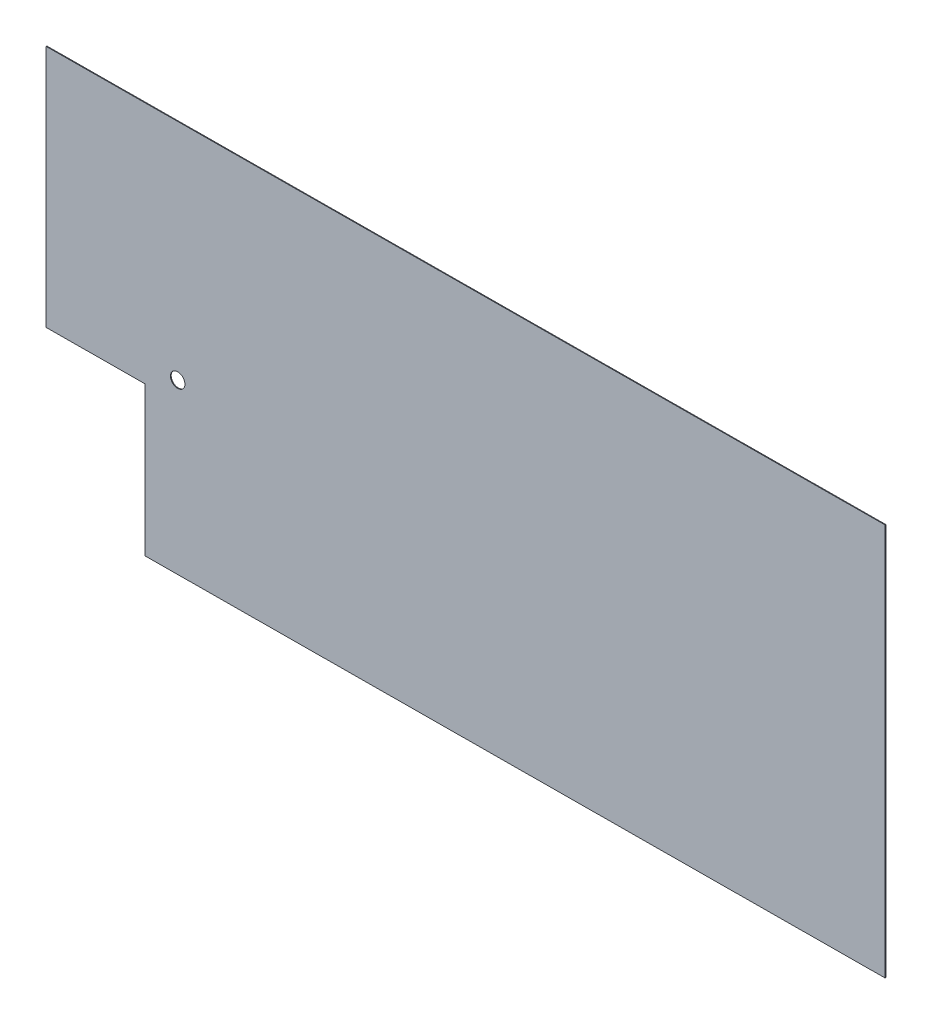
ISO-10303-21;
HEADER;
FILE_DESCRIPTION(('STEP AP214'),'2;1');
FILE_NAME('part.step','',(''),(''),'','','');
FILE_SCHEMA(('AUTOMOTIVE_DESIGN { 1 0 10303 214 1 1 1 1 }'));
ENDSEC;
DATA;
#1=APPLICATION_CONTEXT('core data for automotive mechanical design processes');
#2=APPLICATION_PROTOCOL_DEFINITION('international standard','automotive_design',2000,#1);
#3=PRODUCT_CONTEXT('',#1,'mechanical');
#4=PRODUCT('Part','Part','',(#3));
#5=PRODUCT_RELATED_PRODUCT_CATEGORY('part','',(#4));
#6=PRODUCT_DEFINITION_FORMATION('','',#4);
#7=PRODUCT_DEFINITION_CONTEXT('part definition',#1,'design');
#8=PRODUCT_DEFINITION('design','',#6,#7);
#9=PRODUCT_DEFINITION_SHAPE('','',#8);
#10=(LENGTH_UNIT() NAMED_UNIT(*) SI_UNIT(.MILLI.,.METRE.));
#11=(NAMED_UNIT(*) PLANE_ANGLE_UNIT() SI_UNIT($,.RADIAN.));
#12=(NAMED_UNIT(*) SI_UNIT($,.STERADIAN.) SOLID_ANGLE_UNIT());
#13=UNCERTAINTY_MEASURE_WITH_UNIT(LENGTH_MEASURE(1.E-05),#10,'distance_accuracy_value','');
#14=(GEOMETRIC_REPRESENTATION_CONTEXT(3) GLOBAL_UNCERTAINTY_ASSIGNED_CONTEXT((#13)) GLOBAL_UNIT_ASSIGNED_CONTEXT((#10,
#11,#12)) REPRESENTATION_CONTEXT('',''));
#15=CARTESIAN_POINT('',(0.,0.,0.));
#16=DIRECTION('',(0.,0.,1.));
#17=DIRECTION('',(1.,0.,0.));
#18=AXIS2_PLACEMENT_3D('',#15,#16,#17);
#19=CARTESIAN_POINT('',(-4.99393203883525,754.,-822.984848367691));
#20=DIRECTION('',(0.999981589754181,0.,-0.00606796116504866));
#21=DIRECTION('',(0.,1.,0.));
#22=AXIS2_PLACEMENT_3D('',#19,#20,#21);
#23=PLANE('',#22);
#24=DIRECTION('',(0.00606796116504866,0.,0.999981589754181));
#25=VECTOR('',#24,1.);
#26=CARTESIAN_POINT('',(-4.99393203883525,1093.,-822.984848367691));
#27=LINE('',#26,#25);
#28=CARTESIAN_POINT('',(-5.00000000000078,1093.,-823.984829957446));
#29=VERTEX_POINT('',#28);
#30=CARTESIAN_POINT('',(-4.9878640776706,1093.,-821.984866777937));
#31=VERTEX_POINT('',#30);
#32=EDGE_CURVE('E11',#29,#31,#27,.T.);
#33=ORIENTED_EDGE('',*,*,#32,.F.);
#34=DIRECTION('',(0.,1.,0.));
#35=VECTOR('',#34,1.);
#36=CARTESIAN_POINT('',(-5.00000000000078,754.,-823.984829957446));
#37=LINE('',#36,#35);
#38=CARTESIAN_POINT('',(-5.00000000000078,415.,-823.984829957446));
#39=VERTEX_POINT('',#38);
#40=EDGE_CURVE('E118',#29,#39,#37,.F.);
#41=ORIENTED_EDGE('',*,*,#40,.T.);
#42=DIRECTION('',(0.00606796116504866,0.,0.999981589754181));
#43=VECTOR('',#42,1.);
#44=CARTESIAN_POINT('',(-4.99393203883525,415.,-822.984848367691));
#45=LINE('',#44,#43);
#46=CARTESIAN_POINT('',(-4.9878640776706,415.,-821.984866777937));
#47=VERTEX_POINT('',#46);
#48=EDGE_CURVE('E51',#39,#47,#45,.T.);
#49=ORIENTED_EDGE('',*,*,#48,.T.);
#50=DIRECTION('',(0.,1.,0.));
#51=VECTOR('',#50,1.);
#52=CARTESIAN_POINT('',(-4.9878640776706,754.,-821.984866777937));
#53=LINE('',#52,#51);
#54=EDGE_CURVE('E131',#31,#47,#53,.F.);
#55=ORIENTED_EDGE('',*,*,#54,.F.);
#56=EDGE_LOOP('',(#33,#41,#49,#55));
#57=FACE_BOUND('',#56,.T.);
#58=ADVANCED_FACE('F40',(#57),#23,.F.);
#59=CARTESIAN_POINT('',(1156.30423815181,415.,-830.031690299542));
#60=DIRECTION('',(0.,-1.,0.));
#61=DIRECTION('',(0.999981589754181,0.,-0.00606796116504866));
#62=AXIS2_PLACEMENT_3D('',#59,#60,#61);
#63=PLANE('',#62);
#64=ORIENTED_EDGE('',*,*,#48,.F.);
#65=DIRECTION('',(0.999981589754181,0.,-0.00606796116504866));
#66=VECTOR('',#65,1.);
#67=CARTESIAN_POINT('',(1156.29817019064,415.,-831.031671889297));
#68=LINE('',#67,#66);
#69=CARTESIAN_POINT('',(267.874554757334,415.,-825.640652642746));
#70=VERTEX_POINT('',#69);
#71=EDGE_CURVE('E111',#39,#70,#68,.T.);
#72=ORIENTED_EDGE('',*,*,#71,.T.);
#73=DIRECTION('',(-0.325913241594478,0.,-0.945399682120414));
#74=VECTOR('',#73,1.);
#75=CARTESIAN_POINT('',(268.562600007169,415.,-823.644790930296));
#76=LINE('',#75,#74);
#77=CARTESIAN_POINT('',(268.562600007169,415.,-823.644790930296));
#78=VERTEX_POINT('',#77);
#79=EDGE_CURVE('E96',#70,#78,#76,.F.);
#80=ORIENTED_EDGE('',*,*,#79,.T.);
#81=DIRECTION('',(0.999981589754181,0.,-0.00606796116504866));
#82=VECTOR('',#81,1.);
#83=CARTESIAN_POINT('',(1156.31030611297,415.,-829.031708709788));
#84=LINE('',#83,#82);
#85=EDGE_CURVE('E143',#47,#78,#84,.T.);
#86=ORIENTED_EDGE('',*,*,#85,.F.);
#87=EDGE_LOOP('',(#64,#72,#80,#86));
#88=FACE_BOUND('',#87,.T.);
#89=ADVANCED_FACE('F115',(#88),#63,.T.);
#90=CARTESIAN_POINT('',(268.562600007169,415.,-823.644790930296));
#91=DIRECTION('',(0.945399682120414,0.,-0.325913241594478));
#92=DIRECTION('',(-0.325913241594478,0.,-0.945399682120414));
#93=AXIS2_PLACEMENT_3D('',#90,#91,#92);
#94=PLANE('',#93);
#95=ORIENTED_EDGE('',*,*,#79,.F.);
#96=DIRECTION('',(0.,1.,0.));
#97=VECTOR('',#96,1.);
#98=CARTESIAN_POINT('',(267.874554757334,754.000000000001,-825.640652642746));
#99=LINE('',#98,#97);
#100=CARTESIAN_POINT('',(267.874554757333,1.11022302462516E-13,-825.640652642746));
#101=VERTEX_POINT('',#100);
#102=EDGE_CURVE('E44',#70,#101,#99,.F.);
#103=ORIENTED_EDGE('',*,*,#102,.T.);
#104=DIRECTION('',(-0.325913241594478,0.,-0.945399682120414));
#105=VECTOR('',#104,1.);
#106=CARTESIAN_POINT('',(268.562600007168,0.,-823.644790930296));
#107=LINE('',#106,#105);
#108=CARTESIAN_POINT('',(268.562600007169,1.11022302462516E-13,-823.644790930297));
#109=VERTEX_POINT('',#108);
#110=EDGE_CURVE('E90',#101,#109,#107,.F.);
#111=ORIENTED_EDGE('',*,*,#110,.T.);
#112=DIRECTION('',(0.,1.,0.));
#113=VECTOR('',#112,1.);
#114=CARTESIAN_POINT('',(268.562600007169,754.000000000001,-823.644790930296));
#115=LINE('',#114,#113);
#116=EDGE_CURVE('E99',#78,#109,#115,.F.);
#117=ORIENTED_EDGE('',*,*,#116,.F.);
#118=EDGE_LOOP('',(#95,#103,#111,#117));
#119=FACE_BOUND('',#118,.T.);
#120=ADVANCED_FACE('F42',(#119),#94,.F.);
#121=CARTESIAN_POINT('',(1156.30423815181,0.,-830.031690299542));
#122=DIRECTION('',(0.,-1.,0.));
#123=DIRECTION('',(0.999981589754181,0.,-0.00606796116504866));
#124=AXIS2_PLACEMENT_3D('',#121,#122,#123);
#125=PLANE('',#124);
#126=ORIENTED_EDGE('',*,*,#110,.F.);
#127=DIRECTION('',(0.999981589754181,0.,-0.00606796116504866));
#128=VECTOR('',#127,1.);
#129=CARTESIAN_POINT('',(1156.29817019064,1.11022302462516E-13,-831.031671889297));
#130=LINE('',#129,#128);
#131=CARTESIAN_POINT('',(2317.59634038129,0.,-838.078513821148));
#132=VERTEX_POINT('',#131);
#133=EDGE_CURVE('E113',#101,#132,#130,.T.);
#134=ORIENTED_EDGE('',*,*,#133,.T.);
#135=DIRECTION('',(0.00606796116504866,0.,0.999981589754181));
#136=VECTOR('',#135,1.);
#137=CARTESIAN_POINT('',(2317.60240834245,0.,-837.078532231394));
#138=LINE('',#137,#136);
#139=CARTESIAN_POINT('',(2317.60847630362,0.,-836.078550641639));
#140=VERTEX_POINT('',#139);
#141=EDGE_CURVE('E133',#132,#140,#138,.T.);
#142=ORIENTED_EDGE('',*,*,#141,.T.);
#143=DIRECTION('',(0.999981589754181,0.,-0.00606796116504866));
#144=VECTOR('',#143,1.);
#145=CARTESIAN_POINT('',(1156.31030611297,1.11022302462516E-13,-829.031708709788));
#146=LINE('',#145,#144);
#147=EDGE_CURVE('E142',#109,#140,#146,.T.);
#148=ORIENTED_EDGE('',*,*,#147,.F.);
#149=EDGE_LOOP('',(#126,#134,#142,#148));
#150=FACE_BOUND('',#149,.T.);
#151=ADVANCED_FACE('F151',(#150),#125,.T.);
#152=CARTESIAN_POINT('',(2317.60240834245,754.,-837.078532231394));
#153=DIRECTION('',(0.999981589754181,0.,-0.00606796116504866));
#154=DIRECTION('',(0.,1.,0.));
#155=AXIS2_PLACEMENT_3D('',#152,#153,#154);
#156=PLANE('',#155);
#157=ORIENTED_EDGE('',*,*,#141,.F.);
#158=DIRECTION('',(0.,1.,0.));
#159=VECTOR('',#158,1.);
#160=CARTESIAN_POINT('',(2317.59634038129,754.,-838.078513821148));
#161=LINE('',#160,#159);
#162=CARTESIAN_POINT('',(2317.59634038129,1093.,-838.078513821148));
#163=VERTEX_POINT('',#162);
#164=EDGE_CURVE('E132',#132,#163,#161,.T.);
#165=ORIENTED_EDGE('',*,*,#164,.T.);
#166=DIRECTION('',(0.00606796116504866,0.,0.999981589754181));
#167=VECTOR('',#166,1.);
#168=CARTESIAN_POINT('',(2317.60240834245,1093.,-837.078532231394));
#169=LINE('',#168,#167);
#170=CARTESIAN_POINT('',(2317.60847630362,1093.,-836.078550641639));
#171=VERTEX_POINT('',#170);
#172=EDGE_CURVE('E60',#163,#171,#169,.T.);
#173=ORIENTED_EDGE('',*,*,#172,.T.);
#174=DIRECTION('',(0.,1.,0.));
#175=VECTOR('',#174,1.);
#176=CARTESIAN_POINT('',(2317.60847630362,754.,-836.078550641639));
#177=LINE('',#176,#175);
#178=EDGE_CURVE('E152',#140,#171,#177,.T.);
#179=ORIENTED_EDGE('',*,*,#178,.F.);
#180=EDGE_LOOP('',(#157,#165,#173,#179));
#181=FACE_BOUND('',#180,.T.);
#182=ADVANCED_FACE('F218',(#181),#156,.T.);
#183=CARTESIAN_POINT('',(1156.30423815181,1093.,-830.031690299542));
#184=DIRECTION('',(0.,-1.,0.));
#185=DIRECTION('',(0.999981589754181,0.,-0.00606796116504866));
#186=AXIS2_PLACEMENT_3D('',#183,#184,#185);
#187=PLANE('',#186);
#188=DIRECTION('',(0.999981589754181,0.,-0.00606796116504866));
#189=VECTOR('',#188,1.);
#190=CARTESIAN_POINT('',(1156.29817019064,1093.,-831.031671889297));
#191=LINE('',#190,#189);
#192=EDGE_CURVE('E127',#163,#29,#191,.F.);
#193=ORIENTED_EDGE('',*,*,#192,.T.);
#194=ORIENTED_EDGE('',*,*,#32,.T.);
#195=DIRECTION('',(0.999981589754181,0.,-0.00606796116504866));
#196=VECTOR('',#195,1.);
#197=CARTESIAN_POINT('',(1156.31030611297,1093.,-829.031708709788));
#198=LINE('',#197,#196);
#199=EDGE_CURVE('E139',#171,#31,#198,.F.);
#200=ORIENTED_EDGE('',*,*,#199,.F.);
#201=ORIENTED_EDGE('',*,*,#172,.F.);
#202=EDGE_LOOP('',(#193,#194,#200,#201));
#203=FACE_BOUND('',#202,.T.);
#204=ADVANCED_FACE('F216',(#203),#187,.F.);
#205=CARTESIAN_POINT('',(1156.31030611297,754.,-829.031708709788));
#206=DIRECTION('',(0.00606796116504866,0.,0.999981589754181));
#207=DIRECTION('',(0.999981589754181,0.,-0.00606796116504866));
#208=AXIS2_PLACEMENT_3D('',#205,#206,#207);
#209=PLANE('',#208);
#210=CARTESIAN_POINT('',(339.074950675495,469.0000000268,-824.072665013075));
#211=CARTESIAN_POINT('',(339.074952175354,468.328584783968,-824.072665022177));
#212=CARTESIAN_POINT('',(339.109270419942,467.657108868376,-824.072873267786));
#213=CARTESIAN_POINT('',(339.245169879086,466.321042548984,-824.073697915608));
#214=CARTESIAN_POINT('',(339.346748960097,465.656451927458,-824.074314304875));
#215=CARTESIAN_POINT('',(339.593612302406,464.449151278049,-824.075812289627));
#216=CARTESIAN_POINT('',(339.728953983658,463.904381306161,-824.076633552813));
#217=CARTESIAN_POINT('',(340.044908442255,462.827879149409,-824.078550787494));
#218=CARTESIAN_POINT('',(340.225531299392,462.296149896439,-824.079646820155));
#219=CARTESIAN_POINT('',(340.529891044368,461.51132230611,-824.081493697269));
#220=CARTESIAN_POINT('',(340.637000907703,461.251665596134,-824.082143647726));
#221=CARTESIAN_POINT('',(340.86218373962,460.737150092206,-824.083510073562));
#222=CARTESIAN_POINT('',(340.980256731423,460.482291308418,-824.084226549081));
#223=CARTESIAN_POINT('',(341.350458081397,459.725569546191,-824.086472957853));
#224=CARTESIAN_POINT('',(341.618616336485,459.231438855324,-824.088100161688));
#225=CARTESIAN_POINT('',(342.195074381275,458.267799266706,-824.091598151116));
#226=CARTESIAN_POINT('',(342.503342534786,457.798271368953,-824.093468744738));
#227=CARTESIAN_POINT('',(343.158007303258,456.886586975724,-824.097441298265));
#228=CARTESIAN_POINT('',(343.504402925405,456.444429768001,-824.099543252145));
#229=CARTESIAN_POINT('',(344.23306707273,455.590874551994,-824.103964839296));
#230=CARTESIAN_POINT('',(344.615328194218,455.179470226782,-824.10628442764));
#231=CARTESIAN_POINT('',(345.413449958345,454.390659581939,-824.111127488672));
#232=CARTESIAN_POINT('',(345.829310711533,454.013253374179,-824.11365096203));
#233=CARTESIAN_POINT('',(346.692037001546,453.293955871417,-824.118886048033));
#234=CARTESIAN_POINT('',(347.138960933633,452.952134658138,-824.121598015025));
#235=CARTESIAN_POINT('',(348.059793722772,452.307013749988,-824.1271856955));
#236=CARTESIAN_POINT('',(348.533703530013,452.003715412744,-824.130061414748));
#237=CARTESIAN_POINT('',(349.505342994727,451.437768861924,-824.135957393833));
#238=CARTESIAN_POINT('',(350.003074469016,451.175123755352,-824.138977664694));
#239=CARTESIAN_POINT('',(350.764818901969,450.813411875849,-824.143599985429));
#240=CARTESIAN_POINT('',(351.021279558414,450.698209217535,-824.145156207383));
#241=CARTESIAN_POINT('',(351.538873406772,450.478828487614,-824.148297004576));
#242=CARTESIAN_POINT('',(351.800006590889,450.374650397616,-824.149881579769));
#243=CARTESIAN_POINT('',(352.590833119863,450.078427140048,-824.154680372782));
#244=CARTESIAN_POINT('',(353.126924769694,449.903181193952,-824.157933415983));
#245=CARTESIAN_POINT('',(354.211890570841,449.598290184663,-824.164517067537));
#246=CARTESIAN_POINT('',(354.760765850328,449.468649162546,-824.167847682735));
#247=CARTESIAN_POINT('',(355.867441774931,449.255716661479,-824.1745630729));
#248=CARTESIAN_POINT('',(356.425242535724,449.172425783747,-824.177947848568));
#249=CARTESIAN_POINT('',(357.545899357321,449.052978130169,-824.184748075835));
#250=CARTESIAN_POINT('',(358.108754956869,449.016817096848,-824.188163524634));
#251=CARTESIAN_POINT('',(358.954231121697,448.998541146611,-824.19329393562));
#252=CARTESIAN_POINT('',(359.236562343049,448.998462945255,-824.195007142048));
#253=CARTESIAN_POINT('',(359.800971447485,449.010350512539,-824.198432017627));
#254=CARTESIAN_POINT('',(360.083049329275,449.022316342317,-824.200143686772));
#255=CARTESIAN_POINT('',(360.928159622313,449.07611148578,-824.205271877621));
#256=CARTESIAN_POINT('',(361.490153407282,449.135836677355,-824.208682096867));
#257=CARTESIAN_POINT('',(362.60705317246,449.302214176087,-824.215459526041));
#258=CARTESIAN_POINT('',(363.161959347974,449.408865187283,-824.218826737155));
#259=CARTESIAN_POINT('',(364.260873553531,449.668306810475,-824.225495028644));
#260=CARTESIAN_POINT('',(364.80488214217,449.821095051048,-824.228796112407));
#261=CARTESIAN_POINT('',(365.877594682711,450.17193830677,-824.235305410282));
#262=CARTESIAN_POINT('',(366.406311487938,450.369953982559,-824.238513702389));
#263=CARTESIAN_POINT('',(367.444915217162,450.810400686034,-824.24481602551));
#264=CARTESIAN_POINT('',(367.954801897487,451.052832288242,-824.247910055047));
#265=CARTESIAN_POINT('',(368.952320239554,451.579740142177,-824.253963069046));
#266=CARTESIAN_POINT('',(369.439953009069,451.86421429808,-824.25692206023));
#267=CARTESIAN_POINT('',(370.389667241782,452.47301412735,-824.262684995409));
#268=CARTESIAN_POINT('',(370.851748060552,452.797340805143,-824.265488935494));
#269=CARTESIAN_POINT('',(371.746367629377,453.483156167313,-824.270917552237));
#270=CARTESIAN_POINT('',(372.178953299703,453.844583423546,-824.273542513611));
#271=CARTESIAN_POINT('',(372.803609770618,454.413112882475,-824.277332974601));
#272=CARTESIAN_POINT('',(373.007807454583,454.607037906361,-824.278572061029));
#273=CARTESIAN_POINT('',(373.407732098095,455.00343441923,-824.280998832913));
#274=CARTESIAN_POINT('',(373.603459064168,455.205905901629,-824.282186518407));
#275=CARTESIAN_POINT('',(374.177444300262,455.825479544812,-824.285669502652));
#276=CARTESIAN_POINT('',(374.542616220354,456.254840469881,-824.287885392477));
#277=CARTESIAN_POINT('',(375.235603274204,457.142682538101,-824.292090488424));
#278=CARTESIAN_POINT('',(375.563415260795,457.601166129461,-824.294079675449));
#279=CARTESIAN_POINT('',(376.178940525812,458.543145122823,-824.297814727617));
#280=CARTESIAN_POINT('',(376.466723787482,459.02659479323,-824.299561017422));
#281=CARTESIAN_POINT('',(377.000654100661,460.015999684072,-824.302800945476));
#282=CARTESIAN_POINT('',(377.246805072431,460.521952779822,-824.304294607512));
#283=CARTESIAN_POINT('',(377.583000145425,461.295099422616,-824.306334663716));
#284=CARTESIAN_POINT('',(377.689570187765,461.555214884852,-824.3069813385));
#285=CARTESIAN_POINT('',(377.891539954353,462.079747459035,-824.308206905763));
#286=CARTESIAN_POINT('',(377.98693961477,462.344164595553,-824.308785797855));
#287=CARTESIAN_POINT('',(378.25625194264,463.143126324075,-824.310420004688));
#288=CARTESIAN_POINT('',(378.413311055489,463.683457490496,-824.311373050831));
#289=CARTESIAN_POINT('',(378.681368127529,464.774449967184,-824.31299964068));
#290=CARTESIAN_POINT('',(378.792437652468,465.325093823066,-824.313673618653));
#291=CARTESIAN_POINT('',(378.968135056628,466.433734533422,-824.314739763306));
#292=CARTESIAN_POINT('',(379.032765560813,466.991730970475,-824.315131945916));
#293=CARTESIAN_POINT('',(379.114734102223,468.111222716915,-824.315629336999));
#294=CARTESIAN_POINT('',(379.132070318143,468.672718160215,-824.315734534421));
#295=CARTESIAN_POINT('',(379.118809720978,469.795148377628,-824.31565406815));
#296=CARTESIAN_POINT('',(379.088212075772,470.356083141839,-824.315468399409));
#297=CARTESIAN_POINT('',(378.980024848169,471.473159084359,-824.314811911427));
#298=CARTESIAN_POINT('',(378.902454287958,472.02930211072,-824.314341207615));
#299=CARTESIAN_POINT('',(378.70111444451,473.133154837478,-824.313119462771));
#300=CARTESIAN_POINT('',(378.577344069219,473.680864338209,-824.312368415114));
#301=CARTESIAN_POINT('',(378.284339120088,474.764093713258,-824.310590439728));
#302=CARTESIAN_POINT('',(378.115102697336,475.299613090895,-824.309563500781));
#303=CARTESIAN_POINT('',(377.82781033987,476.090586390828,-824.307820189818));
#304=CARTESIAN_POINT('',(377.726463403566,476.352214537696,-824.307205209223));
#305=CARTESIAN_POINT('',(377.512706199904,476.870911505566,-824.305908114932));
#306=CARTESIAN_POINT('',(377.400295936653,477.12798032826,-824.305226001262));
#307=CARTESIAN_POINT('',(377.046565834361,477.89237554854,-824.303079541221));
#308=CARTESIAN_POINT('',(376.788969423898,478.392278150118,-824.301516427429));
#309=CARTESIAN_POINT('',(376.232794867,479.368703422376,-824.298141519684));
#310=CARTESIAN_POINT('',(375.934213216145,479.845224089063,-824.296329704466));
#311=CARTESIAN_POINT('',(375.298271341336,480.771656922457,-824.292470762823));
#312=CARTESIAN_POINT('',(374.960910467409,481.221568642984,-824.290423632453));
#313=CARTESIAN_POINT('',(374.249596612628,482.091512049361,-824.286107328142));
#314=CARTESIAN_POINT('',(373.875646950778,482.511546439456,-824.28383817434));
#315=CARTESIAN_POINT('',(373.288560056598,483.11705250429,-824.28027568828));
#316=CARTESIAN_POINT('',(373.088205942675,483.315056143921,-824.279059924915));
#317=CARTESIAN_POINT('',(372.679248696577,483.702352719295,-824.276578342541));
#318=CARTESIAN_POINT('',(372.470645513868,483.891645601659,-824.275312523225));
#319=CARTESIAN_POINT('',(371.833097763102,484.446056389193,-824.271443837009));
#320=CARTESIAN_POINT('',(371.392357640631,484.797765506333,-824.268769393825));
#321=CARTESIAN_POINT('',(370.483057289835,485.462965174763,-824.263251693027));
#322=CARTESIAN_POINT('',(370.014497566065,485.776456418881,-824.260408438474));
#323=CARTESIAN_POINT('',(369.052715495149,486.363137401864,-824.254572274774));
#324=CARTESIAN_POINT('',(368.559494522956,486.636329384209,-824.251579373969));
#325=CARTESIAN_POINT('',(367.803712365125,487.014210949669,-824.246993232754));
#326=CARTESIAN_POINT('',(367.549031736174,487.134891523151,-824.245447812136));
#327=CARTESIAN_POINT('',(367.034769095233,487.365313273446,-824.242327228951));
#328=CARTESIAN_POINT('',(366.77518711266,487.475054515891,-824.240752066563));
#329=CARTESIAN_POINT('',(365.989786958281,487.787511641157,-824.235986201186));
#330=CARTESIAN_POINT('',(365.457211859471,487.973512303251,-824.232754496673));
#331=CARTESIAN_POINT('',(364.37841883179,488.300056202502,-824.226208301959));
#332=CARTESIAN_POINT('',(363.83220155359,488.440601603224,-824.222893815706));
#333=CARTESIAN_POINT('',(362.729916581183,488.675521207358,-824.21620507016));
#334=CARTESIAN_POINT('',(362.173848689398,488.769894483583,-824.212830809666));
#335=CARTESIAN_POINT('',(361.055857900588,488.911663771668,-824.20604676008));
#336=CARTESIAN_POINT('',(360.493936918798,488.959074690932,-824.20263698261));
#337=CARTESIAN_POINT('',(359.649707434912,488.99439437731,-824.197514136575));
#338=CARTESIAN_POINT('',(359.368048937001,489.000200462188,-824.195805012283));
#339=CARTESIAN_POINT('',(358.804740816556,488.999788934876,-824.192386817554));
#340=CARTESIAN_POINT('',(358.523091194024,488.993571320737,-824.190677747118));
#341=CARTESIAN_POINT('',(357.678961839336,488.957024846581,-824.185555508673));
#342=CARTESIAN_POINT('',(357.117157180109,488.908808330006,-824.182146437057));
#343=CARTESIAN_POINT('',(355.999601031846,488.765468324197,-824.175365024902));
#344=CARTESIAN_POINT('',(355.443850039914,488.670341012053,-824.17199268738));
#345=CARTESIAN_POINT('',(354.342483501728,488.433997701838,-824.165309514959));
#346=CARTESIAN_POINT('',(353.796863404374,488.292802955359,-824.161998652444));
#347=CARTESIAN_POINT('',(352.719444192978,487.965103035532,-824.155460794147));
#348=CARTESIAN_POINT('',(352.187643810326,487.77860203755,-824.152233790668));
#349=CARTESIAN_POINT('',(351.141853696899,487.360966134576,-824.145887860042));
#350=CARTESIAN_POINT('',(350.627864217072,487.129830601007,-824.142768934419));
#351=CARTESIAN_POINT('',(349.621177617009,486.625021319542,-824.136660286763));
#352=CARTESIAN_POINT('',(349.128482290741,486.351343996527,-824.133670575616));
#353=CARTESIAN_POINT('',(348.16797922831,485.76388990398,-824.127842173032));
#354=CARTESIAN_POINT('',(347.700158982433,485.4501335656,-824.125003405685));
#355=CARTESIAN_POINT('',(346.792389726971,484.784529605132,-824.119494995685));
#356=CARTESIAN_POINT('',(346.352439020317,484.432684305949,-824.116825342733));
#357=CARTESIAN_POINT('',(345.716045241389,483.878128476373,-824.112963658903));
#358=CARTESIAN_POINT('',(345.507816558485,483.688791794085,-824.111700112079));
#359=CARTESIAN_POINT('',(345.099604715721,483.301429321405,-824.109223052867));
#360=CARTESIAN_POINT('',(344.899621511144,483.103403578148,-824.108009540207));
#361=CARTESIAN_POINT('',(344.312615221319,482.496816821291,-824.104447543259));
#362=CARTESIAN_POINT('',(343.938451109497,482.075672792408,-824.10217708816));
#363=CARTESIAN_POINT('',(343.227176974005,481.203834421196,-824.097861024868));
#364=CARTESIAN_POINT('',(342.890037958911,480.753163646851,-824.095815240754));
#365=CARTESIAN_POINT('',(342.254626174613,479.825198867051,-824.091959515738));
#366=CARTESIAN_POINT('',(341.956353917889,479.347904510669,-824.090149577946));
#367=CARTESIAN_POINT('',(341.400761819851,478.369692677941,-824.086778204604));
#368=CARTESIAN_POINT('',(341.143459195437,477.86876538422,-824.085216873527));
#369=CARTESIAN_POINT('',(340.790131946014,477.102492350908,-824.083072858027));
#370=CARTESIAN_POINT('',(340.677785559052,476.844564393553,-824.082391131963));
#371=CARTESIAN_POINT('',(340.464222065708,476.324140835307,-824.081095213121));
#372=CARTESIAN_POINT('',(340.363005029024,476.061645205822,-824.080481020765));
#373=CARTESIAN_POINT('',(340.070864330367,475.253304268342,-824.078708289714));
#374=CARTESIAN_POINT('',(339.898011162659,474.700806956101,-824.077659404096));
#375=CARTESIAN_POINT('',(339.600619008273,473.582950371683,-824.07585480683));
#376=CARTESIAN_POINT('',(339.476088501504,473.017588860443,-824.075099146639));
#377=CARTESIAN_POINT('',(339.276312491995,471.878922220276,-824.073886891253));
#378=CARTESIAN_POINT('',(339.201005616047,471.305627896899,-824.073429923641));
#379=CARTESIAN_POINT('',(339.100333750341,470.154902890722,-824.072819039424));
#380=CARTESIAN_POINT('',(339.07494938549,469.577473899959,-824.072665005248));
#381=CARTESIAN_POINT('',(339.074950675495,469.0000000268,-824.072665013075));
#382=B_SPLINE_CURVE_WITH_KNOTS('',3,(#210,#211,#212,#213,#214,#215,#216,#217,#218,#219,#220,
#221,#222,#223,#224,#225,#226,#227,#228,#229,#230,#231,#232,#233,#234,#235,#236,#237,#238,#239,
#240,#241,#242,#243,#244,#245,#246,#247,#248,#249,#250,#251,#252,#253,#254,#255,#256,#257,#258,
#259,#260,#261,#262,#263,#264,#265,#266,#267,#268,#269,#270,#271,#272,#273,#274,#275,#276,#277,
#278,#279,#280,#281,#282,#283,#284,#285,#286,#287,#288,#289,#290,#291,#292,#293,#294,#295,#296,
#297,#298,#299,#300,#301,#302,#303,#304,#305,#306,#307,#308,#309,#310,#311,#312,#313,#314,#315,
#316,#317,#318,#319,#320,#321,#322,#323,#324,#325,#326,#327,#328,#329,#330,#331,#332,#333,#334,
#335,#336,#337,#338,#339,#340,#341,#342,#343,#344,#345,#346,#347,#348,#349,#350,#351,#352,#353,
#354,#355,#356,#357,#358,#359,#360,#361,#362,#363,#364,#365,#366,#367,#368,#369,#370,#371,#372,
#373,#374,#375,#376,#377,#378,#379,#380,#381),.UNSPECIFIED.,.T.,.F.,(4,2,2,2,2,2,2,2,2,2,2,2,2,
2,2,2,2,2,2,2,2,2,2,2,2,2,2,2,2,2,2,2,2,2,2,2,2,2,2,2,2,2,2,2,2,2,2,2,2,2,2,2,2,2,2,2,2,2,2,2,2,
2,2,2,2,2,2,2,2,2,2,2,2,2,2,2,2,2,2,2,2,2,2,2,2,4),(0.,2.01353392695023,4.02700398669605,
5.70914538217013,7.39166156289531,8.234086212132,9.07651264581491,10.760973159179,
12.4441130387638,14.12720910087,15.8099584838925,17.4927134037393,19.1787220547762,
20.8647901078504,22.5509869584558,23.3942214977714,24.2374546303953,25.9273256999313,
27.6173464720607,29.3073891653203,30.9972791779925,31.8440640693849,32.6908532593373,
34.3841782275761,36.0774564338275,37.7706476215787,39.4623716226229,41.1541175077313,
42.8457790876292,44.5374833122071,46.2264303966458,47.0710434810041,47.9156559147641,
49.6044386485476,51.2933635388284,52.9792974908214,54.665072600086,55.5081520887304,
56.3512363947962,58.0371564276551,59.7204430006888,61.4036344185279,63.0868906552236,
64.7701761131278,66.4527803618988,68.1354243859701,69.8181368464537,70.659633679672,
71.5011302004871,73.1860722213508,74.8711584020827,76.5562728303415,78.2412345416282,
79.0860777051074,79.9309260448618,81.6203765225386,83.3097963686769,84.9991221284454,
85.8443953237909,86.689663447499,88.3798562670362,90.0699686254502,91.7601149217991,
93.449724537808,94.2946730180269,95.1396216351712,96.8290865863067,98.5186892400169,
100.207513554384,101.896182287845,103.584874804141,105.273709311314,106.961686308532,
108.649560420214,109.493664803831,110.33776460901,112.025629706165,113.712163602028,
115.398719733541,117.085982756098,117.929762222285,118.773546972376,120.507891631563,
122.242540504946,123.975022429757,125.706831839724),.UNSPECIFIED.);
#383=CARTESIAN_POINT('',(379.126827566034,469.,-824.315702721018));
#384=VERTEX_POINT('',#383);
#385=EDGE_CURVE('E122',#384,#384,#382,.F.);
#386=ORIENTED_EDGE('',*,*,#385,.T.);
#387=EDGE_LOOP('',(#386));
#388=FACE_BOUND('',#387,.T.);
#389=ORIENTED_EDGE('',*,*,#178,.T.);
#390=ORIENTED_EDGE('',*,*,#199,.T.);
#391=ORIENTED_EDGE('',*,*,#54,.T.);
#392=ORIENTED_EDGE('',*,*,#85,.T.);
#393=ORIENTED_EDGE('',*,*,#116,.T.);
#394=ORIENTED_EDGE('',*,*,#147,.T.);
#395=EDGE_LOOP('',(#389,#390,#391,#392,#393,#394));
#396=FACE_BOUND('',#395,.T.);
#397=ADVANCED_FACE('F149',(#388,#396),#209,.T.);
#398=CARTESIAN_POINT('',(1156.29817019064,754.,-831.031671889297));
#399=DIRECTION('',(0.00606796116504866,0.,0.999981589754181));
#400=DIRECTION('',(0.999981589754181,0.,-0.00606796116504866));
#401=AXIS2_PLACEMENT_3D('',#398,#399,#400);
#402=PLANE('',#401);
#403=CARTESIAN_POINT('',(339.111430960637,469.000000024332,-826.072923199274));
#404=CARTESIAN_POINT('',(339.111432415973,469.671394371171,-826.072923208105));
#405=CARTESIAN_POINT('',(339.145653939678,470.342848187122,-826.073130866805));
#406=CARTESIAN_POINT('',(339.281199721399,471.678903886554,-826.073953368487));
#407=CARTESIAN_POINT('',(339.382521656179,472.343506006455,-826.074568197371));
#408=CARTESIAN_POINT('',(339.62899092243,473.551834998791,-826.076063790842));
#409=CARTESIAN_POINT('',(339.764294214453,474.097596151142,-826.076884821078));
#410=CARTESIAN_POINT('',(340.080255350267,475.176081349034,-826.078802096278));
#411=CARTESIAN_POINT('',(340.260923331118,475.708802451444,-826.079898402753));
#412=CARTESIAN_POINT('',(340.565421845941,476.495110421861,-826.081746121932));
#413=CARTESIAN_POINT('',(340.672590127967,476.755260208834,-826.082396426878));
#414=CARTESIAN_POINT('',(340.89791136495,477.270758639712,-826.083763692566));
#415=CARTESIAN_POINT('',(341.016064345023,477.526107272637,-826.08448065346));
#416=CARTESIAN_POINT('',(341.386543350173,478.284289838733,-826.086728747063));
#417=CARTESIAN_POINT('',(341.654936957909,478.779382910244,-826.088357379035));
#418=CARTESIAN_POINT('',(342.231946568775,479.744821204885,-826.091858715406));
#419=CARTESIAN_POINT('',(342.540524694286,480.215189154929,-826.093731189961));
#420=CARTESIAN_POINT('',(343.195942239001,481.128475078535,-826.097708311389));
#421=CARTESIAN_POINT('',(343.542780583001,481.571393822942,-826.099812951738));
#422=CARTESIAN_POINT('',(344.2724816247,482.426344493428,-826.104240830839));
#423=CARTESIAN_POINT('',(344.655336615651,482.838382993432,-826.106564022827));
#424=CARTESIAN_POINT('',(345.454786098481,483.62831366243,-826.111415140552));
#425=CARTESIAN_POINT('',(345.87138075344,484.006205666357,-826.11394306728));
#426=CARTESIAN_POINT('',(346.734767341825,484.725523599301,-826.119182160022));
#427=CARTESIAN_POINT('',(347.181552439549,485.066957738212,-826.121893284556));
#428=CARTESIAN_POINT('',(348.102118669632,485.711248501386,-826.127479347531));
#429=CARTESIAN_POINT('',(348.575900640201,486.014103926895,-826.130354291058));
#430=CARTESIAN_POINT('',(349.54730104495,486.57906909734,-826.136248819509));
#431=CARTESIAN_POINT('',(350.044921097086,486.841176071425,-826.139268414252));
#432=CARTESIAN_POINT('',(350.806512053352,487.201976669059,-826.143889803679));
#433=CARTESIAN_POINT('',(351.062924008857,487.316858258698,-826.145445730113));
#434=CARTESIAN_POINT('',(351.580422693765,487.535559309964,-826.148585949848));
#435=CARTESIAN_POINT('',(351.84150941579,487.639378789049,-826.150170243105));
#436=CARTESIAN_POINT('',(352.63094037469,487.934011773649,-826.154960567697));
#437=CARTESIAN_POINT('',(353.165637259132,488.108085903585,-826.15820514736));
#438=CARTESIAN_POINT('',(354.247731722869,488.410706683448,-826.164771375429));
#439=CARTESIAN_POINT('',(354.795130410664,488.539249343751,-826.168093030561));
#440=CARTESIAN_POINT('',(355.898772743475,488.750044542416,-826.17479001267));
#441=CARTESIAN_POINT('',(356.455016439535,488.832296813538,-826.178165339956));
#442=CARTESIAN_POINT('',(357.572482726411,488.949711572872,-826.184946206826));
#443=CARTESIAN_POINT('',(358.133704848277,488.984878449933,-826.188351743563));
#444=CARTESIAN_POINT('',(358.976259789769,489.001673401992,-826.193464428353));
#445=CARTESIAN_POINT('',(359.25733369047,489.001272490971,-826.195170005267));
#446=CARTESIAN_POINT('',(359.819208711557,488.988477038839,-826.198579503844));
#447=CARTESIAN_POINT('',(360.100009830508,488.976082435056,-826.200283425499));
#448=CARTESIAN_POINT('',(360.941264485712,488.921078092149,-826.205388220057));
#449=CARTESIAN_POINT('',(361.500653035838,488.860649434086,-826.208782630547));
#450=CARTESIAN_POINT('',(362.612290484417,488.693084024223,-826.215528127601));
#451=CARTESIAN_POINT('',(363.164539600696,488.585948700935,-826.218879215486));
#452=CARTESIAN_POINT('',(364.258109342589,488.325769347073,-826.22551507638));
#453=CARTESIAN_POINT('',(364.799430543237,488.172727738874,-826.228799852876));
#454=CARTESIAN_POINT('',(365.866687485933,487.821641592119,-826.235276045786));
#455=CARTESIAN_POINT('',(366.392638176783,487.623642541194,-826.238467552909));
#456=CARTESIAN_POINT('',(367.4257339048,487.183493424591,-826.244736453079));
#457=CARTESIAN_POINT('',(367.93287870077,486.941342792882,-826.247813844661));
#458=CARTESIAN_POINT('',(368.92497788013,486.415279117986,-826.253833974786));
#459=CARTESIAN_POINT('',(369.409933324179,486.131368073704,-826.256776719763));
#460=CARTESIAN_POINT('',(370.354401515032,485.523990406719,-826.262507821578));
#461=CARTESIAN_POINT('',(370.813913571943,485.200522712205,-826.265296174229));
#462=CARTESIAN_POINT('',(371.704104449139,484.516311246293,-826.270697917348));
#463=CARTESIAN_POINT('',(372.134794836822,484.15558257901,-826.273311378009));
#464=CARTESIAN_POINT('',(372.756709086646,483.588270606827,-826.277085199002));
#465=CARTESIAN_POINT('',(372.960009306918,483.394779834138,-826.278318839555));
#466=CARTESIAN_POINT('',(373.358177177567,482.99930788291,-826.280734951213));
#467=CARTESIAN_POINT('',(373.553044836378,482.797326712863,-826.281917422368));
#468=CARTESIAN_POINT('',(374.124517572585,482.179300261355,-826.285385160581));
#469=CARTESIAN_POINT('',(374.488096978539,481.751076575251,-826.287591386914));
#470=CARTESIAN_POINT('',(375.178109278699,480.865716795864,-826.291778431839));
#471=CARTESIAN_POINT('',(375.504538993839,480.408578233404,-826.29375923114));
#472=CARTESIAN_POINT('',(376.118263172534,479.468411715941,-826.297483354184));
#473=CARTESIAN_POINT('',(376.405537635026,478.985370703832,-826.29922655656));
#474=CARTESIAN_POINT('',(376.938573660597,477.996867116287,-826.30246105801));
#475=CARTESIAN_POINT('',(377.184339006665,477.49140658939,-826.303952380042));
#476=CARTESIAN_POINT('',(377.520083257095,476.719054634525,-826.305989700622));
#477=CARTESIAN_POINT('',(377.626524747419,476.459212042967,-826.306635595343));
#478=CARTESIAN_POINT('',(377.828276416188,475.935240290612,-826.307859839173));
#479=CARTESIAN_POINT('',(377.9235865357,475.671111107128,-826.308438187924));
#480=CARTESIAN_POINT('',(378.192692248545,474.873033026936,-826.310071141002));
#481=CARTESIAN_POINT('',(378.349696221571,474.33331749026,-826.311023852552));
#482=CARTESIAN_POINT('',(378.618133595866,473.242337197237,-826.312652750103));
#483=CARTESIAN_POINT('',(378.729533991634,472.691064378593,-826.313328735824));
#484=CARTESIAN_POINT('',(378.905882863996,471.581144202891,-826.314398833634));
#485=CARTESIAN_POINT('',(378.970833787616,471.022497235894,-826.314792960572));
#486=CARTESIAN_POINT('',(379.053452965461,469.901678619033,-826.315294299764));
#487=CARTESIAN_POINT('',(379.071119103923,469.339506812577,-826.31540149918));
#488=CARTESIAN_POINT('',(379.058530356608,468.215694606802,-826.315325109744));
#489=CARTESIAN_POINT('',(379.028274668098,467.654054216542,-826.315141516021));
#490=CARTESIAN_POINT('',(378.920697840084,466.534883909642,-826.314488731988));
#491=CARTESIAN_POINT('',(378.843341152644,465.977357419805,-826.314019325971));
#492=CARTESIAN_POINT('',(378.642296808713,464.870728015562,-826.31279937424));
#493=CARTESIAN_POINT('',(378.518608036505,464.32162530434,-826.312048821756));
#494=CARTESIAN_POINT('',(378.22562153977,463.235615114568,-826.310270958341));
#495=CARTESIAN_POINT('',(378.056321933616,462.698708140132,-826.309243635992));
#496=CARTESIAN_POINT('',(377.768818522318,461.905673151599,-826.307499044339));
#497=CARTESIAN_POINT('',(377.667381776364,461.643360859823,-826.306883518772));
#498=CARTESIAN_POINT('',(377.4534069679,461.123303943299,-826.30558510404));
#499=CARTESIAN_POINT('',(377.340868908462,460.865559317287,-826.304902214893));
#500=CARTESIAN_POINT('',(376.986816859009,460.099408855869,-826.302753801254));
#501=CARTESIAN_POINT('',(376.728990593945,459.598432459249,-826.301189292687));
#502=CARTESIAN_POINT('',(376.172221625662,458.619910742526,-826.297810778011));
#503=CARTESIAN_POINT('',(375.873275456785,458.142367402009,-826.295996750871));
#504=CARTESIAN_POINT('',(375.236450334869,457.21397789726,-826.29213244962));
#505=CARTESIAN_POINT('',(374.898570905634,456.76313205967,-826.290082172618));
#506=CARTESIAN_POINT('',(374.186048697633,455.891450320346,-826.285758535932));
#507=CARTESIAN_POINT('',(373.811409320333,455.470611648205,-826.283485196886));
#508=CARTESIAN_POINT('',(373.223507499311,454.864395642257,-826.279917765791));
#509=CARTESIAN_POINT('',(373.023108946966,454.666403899723,-826.27870173277));
#510=CARTESIAN_POINT('',(372.614055348619,454.279141862159,-826.276219565723));
#511=CARTESIAN_POINT('',(372.405400251612,454.089871621022,-826.274953431388));
#512=CARTESIAN_POINT('',(371.76768075787,453.535551425129,-826.271083703023));
#513=CARTESIAN_POINT('',(371.326805091766,453.183933230752,-826.26840843735));
#514=CARTESIAN_POINT('',(370.417187165994,452.519014799735,-826.262888809484));
#515=CARTESIAN_POINT('',(369.948445628532,452.205713570669,-826.260044451673));
#516=CARTESIAN_POINT('',(368.986247247567,451.619554196641,-826.254205761773));
#517=CARTESIAN_POINT('',(368.492791910456,451.346693590687,-826.251211438824));
#518=CARTESIAN_POINT('',(367.737175199457,450.969724482868,-826.246626301552));
#519=CARTESIAN_POINT('',(367.482922645978,450.849531355049,-826.245083478528));
#520=CARTESIAN_POINT('',(366.969525978779,450.620090849681,-826.241968150135));
#521=CARTESIAN_POINT('',(366.710381895029,450.510843405094,-826.240395644949));
#522=CARTESIAN_POINT('',(365.926315647089,450.199864509217,-826.235637873814));
#523=CARTESIAN_POINT('',(365.39465773979,450.014845717725,-826.232411734885));
#524=CARTESIAN_POINT('',(364.317762161853,449.690269036558,-826.225877054034));
#525=CARTESIAN_POINT('',(363.7725252746,449.550708530856,-826.222568516866));
#526=CARTESIAN_POINT('',(362.67226386694,449.317776978639,-826.215892050457));
#527=CARTESIAN_POINT('',(362.11723918689,449.224406686231,-826.212524120248));
#528=CARTESIAN_POINT('',(361.002499051709,449.084815118321,-826.205759795866));
#529=CARTESIAN_POINT('',(360.442797166736,449.038486893467,-826.202363484037));
#530=CARTESIAN_POINT('',(359.601958494666,449.004692556595,-826.197261213695));
#531=CARTESIAN_POINT('',(359.321440775906,448.999378508364,-826.195559011734));
#532=CARTESIAN_POINT('',(358.760434434771,449.000737607027,-826.19215478437));
#533=CARTESIAN_POINT('',(358.479945812415,449.007410761771,-826.190452758967));
#534=CARTESIAN_POINT('',(357.639331884241,449.045260002443,-826.185351852387));
#535=CARTESIAN_POINT('',(357.079910103521,449.094259974469,-826.181957240251));
#536=CARTESIAN_POINT('',(355.967180505928,449.238986315587,-826.175205115958));
#537=CARTESIAN_POINT('',(355.413873194502,449.334716518488,-826.171847606867));
#538=CARTESIAN_POINT('',(354.317851842177,449.571981722316,-826.165196869423));
#539=CARTESIAN_POINT('',(353.775125755286,449.713460969046,-826.161903567974));
#540=CARTESIAN_POINT('',(352.703499288073,450.04145781636,-826.155400860472));
#541=CARTESIAN_POINT('',(352.174597612721,450.227971181403,-826.152191446559));
#542=CARTESIAN_POINT('',(351.134580198689,450.645351606261,-826.145880545095));
#543=CARTESIAN_POINT('',(350.623464735334,450.876219352311,-826.142779059213));
#544=CARTESIAN_POINT('',(349.622461809771,451.380194337728,-826.136704900508));
#545=CARTESIAN_POINT('',(349.13257616673,451.653305187749,-826.133732238723));
#546=CARTESIAN_POINT('',(348.177147043104,452.239582892964,-826.12793462517));
#547=CARTESIAN_POINT('',(347.711613438613,452.552765824857,-826.125109733329));
#548=CARTESIAN_POINT('',(346.808310351948,453.216968234199,-826.119628424367));
#549=CARTESIAN_POINT('',(346.370539209277,453.567985445353,-826.116971997169));
#550=CARTESIAN_POINT('',(345.737295754028,454.121103229903,-826.113129429732));
#551=CARTESIAN_POINT('',(345.530096903904,454.309928403676,-826.111872132008));
#552=CARTESIAN_POINT('',(345.123898902441,454.696201212082,-826.109407292932));
#553=CARTESIAN_POINT('',(344.92489970497,454.893648798193,-826.108199751299));
#554=CARTESIAN_POINT('',(344.340772337244,455.498406579968,-826.10465522386));
#555=CARTESIAN_POINT('',(343.968430981525,455.918204640246,-826.102395829378));
#556=CARTESIAN_POINT('',(343.259790689568,456.788056919038,-826.098095748441));
#557=CARTESIAN_POINT('',(342.923542248297,457.238152128745,-826.096055368393));
#558=CARTESIAN_POINT('',(342.289789358295,458.164849337235,-826.092209709669));
#559=CARTESIAN_POINT('',(341.992285525243,458.641451757065,-826.090404434728));
#560=CARTESIAN_POINT('',(341.438060653524,459.618168800965,-826.087041357815));
#561=CARTESIAN_POINT('',(341.181357371198,460.118293539883,-826.085483663589));
#562=CARTESIAN_POINT('',(340.828766139574,460.883282717038,-826.083344114299));
#563=CARTESIAN_POINT('',(340.716637927782,461.140769370967,-826.082663712138));
#564=CARTESIAN_POINT('',(340.503454867292,461.660287238315,-826.08137010179));
#565=CARTESIAN_POINT('',(340.402400092494,461.922318482049,-826.080756894051));
#566=CARTESIAN_POINT('',(340.109849323379,462.731483954317,-826.078981674663));
#567=CARTESIAN_POINT('',(339.936532184714,463.285313160739,-826.077929973635));
#568=CARTESIAN_POINT('',(339.63836222858,464.405876766177,-826.07612065661));
#569=CARTESIAN_POINT('',(339.513518068772,464.972613451455,-826.07536309315));
#570=CARTESIAN_POINT('',(339.313252281078,466.114054739298,-826.074147865755));
#571=CARTESIAN_POINT('',(339.237769289716,466.688748538398,-826.073689829462));
#572=CARTESIAN_POINT('',(339.136867730546,467.842281295824,-826.073077551447));
#573=CARTESIAN_POINT('',(339.111429705835,468.421118555339,-826.072923191659));
#574=CARTESIAN_POINT('',(339.111430960637,469.000000024332,-826.072923199274));
#575=B_SPLINE_CURVE_WITH_KNOTS('',3,(#403,#404,#405,#406,#407,#408,#409,#410,#411,#412,#413,
#414,#415,#416,#417,#418,#419,#420,#421,#422,#423,#424,#425,#426,#427,#428,#429,#430,#431,#432,
#433,#434,#435,#436,#437,#438,#439,#440,#441,#442,#443,#444,#445,#446,#447,#448,#449,#450,#451,
#452,#453,#454,#455,#456,#457,#458,#459,#460,#461,#462,#463,#464,#465,#466,#467,#468,#469,#470,
#471,#472,#473,#474,#475,#476,#477,#478,#479,#480,#481,#482,#483,#484,#485,#486,#487,#488,#489,
#490,#491,#492,#493,#494,#495,#496,#497,#498,#499,#500,#501,#502,#503,#504,#505,#506,#507,#508,
#509,#510,#511,#512,#513,#514,#515,#516,#517,#518,#519,#520,#521,#522,#523,#524,#525,#526,#527,
#528,#529,#530,#531,#532,#533,#534,#535,#536,#537,#538,#539,#540,#541,#542,#543,#544,#545,#546,
#547,#548,#549,#550,#551,#552,#553,#554,#555,#556,#557,#558,#559,#560,#561,#562,#563,#564,#565,
#566,#567,#568,#569,#570,#571,#572,#573,#574),.UNSPECIFIED.,.T.,.F.,(4,2,2,2,2,2,2,2,2,2,2,2,2,
2,2,2,2,2,2,2,2,2,2,2,2,2,2,2,2,2,2,2,2,2,2,2,2,2,2,2,2,2,2,2,2,2,2,2,2,2,2,2,2,2,2,2,2,2,2,2,2,
2,2,2,2,2,2,2,2,2,2,2,2,2,2,2,2,2,2,2,2,2,2,2,2,4),(0.,2.0134727776223,4.0268758458738,
5.71187216667983,7.39724534744653,8.24110388417163,9.08496435036051,10.7722924618915,
12.4580414697103,14.1437431159618,15.8290848770423,17.5144347846966,19.1994043668502,
20.8844262931833,22.5695627491063,23.4122681885007,24.2549722978663,25.9397788991309,
27.6247330924397,29.3096970131174,30.994503866712,31.8375183419962,32.6805372224579,
34.366324603199,36.0520604281771,37.7377073162157,39.4216562188609,41.1056267115204,
42.7895166253826,44.4734521753553,46.156707783933,46.9984737456864,47.8402388654453,
49.5233457167733,51.2065964910147,52.8907038969595,54.5746577365868,55.4168350022612,
56.2590167266573,57.9431320781016,59.6284641590062,61.3137074476787,62.99902614151,
64.6843730661987,66.3709935306681,68.057654613065,69.7443852875511,70.5878925088195,
71.431399496504,73.1195141932904,74.8077712546454,76.4960489674177,78.1841706078298,
79.0290830109439,79.8740006344311,81.5635909285518,83.2531374522381,84.9425811172525,
85.7860675545241,86.6295488254284,88.3161713542247,90.0026968043395,91.6892497879865,
93.3719597782208,94.2134575724871,95.0549559179092,96.7375084647783,98.4201990736708,
100.100846673711,101.781336267248,103.461851862821,105.14251117694,106.823846889017,
108.505081944013,109.345870738453,110.186654801842,111.867891800721,113.551451053623,
115.235037056222,116.919353758543,117.761659985322,118.603971832915,120.34253462776,
122.081407801114,123.818115159059,125.554147171806),.UNSPECIFIED.);
#576=CARTESIAN_POINT('',(379.066075436148,469.,-826.315370893836));
#577=VERTEX_POINT('',#576);
#578=EDGE_CURVE('E171',#577,#577,#575,.F.);
#579=ORIENTED_EDGE('',*,*,#578,.T.);
#580=EDGE_LOOP('',(#579));
#581=FACE_BOUND('',#580,.T.);
#582=ORIENTED_EDGE('',*,*,#164,.F.);
#583=ORIENTED_EDGE('',*,*,#133,.F.);
#584=ORIENTED_EDGE('',*,*,#102,.F.);
#585=ORIENTED_EDGE('',*,*,#71,.F.);
#586=ORIENTED_EDGE('',*,*,#40,.F.);
#587=ORIENTED_EDGE('',*,*,#192,.F.);
#588=EDGE_LOOP('',(#582,#583,#584,#585,#586,#587));
#589=FACE_BOUND('',#588,.T.);
#590=ADVANCED_FACE('F109',(#581,#589),#402,.F.);
#591=CARTESIAN_POINT('',(379.126827566034,469.,-824.315702721018));
#592=CARTESIAN_POINT('',(379.066075436148,469.,-826.315370893836));
#593=CARTESIAN_POINT('',(379.126827561751,466.380683791318,-824.315702720992));
#594=CARTESIAN_POINT('',(379.066075431709,466.38395845195,-826.315370893809));
#595=CARTESIAN_POINT('',(378.604560030491,463.761255761234,-824.31253356355));
#596=CARTESIAN_POINT('',(378.546546216478,463.767805222484,-826.312218352668));
#597=CARTESIAN_POINT('',(376.596249951002,458.922869367262,-824.300346991623));
#598=CARTESIAN_POINT('',(376.547000493876,458.932817860963,-826.300084963497));
#599=CARTESIAN_POINT('',(375.110104783636,456.703670663266,-824.291328954437));
#600=CARTESIAN_POINT('',(375.066878641603,456.713744829074,-826.291103476226));
#601=CARTESIAN_POINT('',(371.402279931426,453.00312326002,-824.268829603008));
#602=CARTESIAN_POINT('',(371.370346134478,453.010902172476,-826.268672647571));
#603=CARTESIAN_POINT('',(369.180339348681,451.521512830474,-824.255346705618));
#604=CARTESIAN_POINT('',(369.15367195453,451.526874081576,-826.255221707096));
#605=CARTESIAN_POINT('',(364.339350920336,449.520002818975,-824.225971235025));
#606=CARTESIAN_POINT('',(364.321038901374,449.521473126377,-826.225896937528));
#607=CARTESIAN_POINT('',(359.100887088129,448.480018839052,-824.194183854713));
#608=CARTESIAN_POINT('',(359.08875116962,448.478548593618,-826.194147034244));
#609=CARTESIAN_POINT('',(353.862423458684,449.520003863037,-824.162396475631));
#610=CARTESIAN_POINT('',(353.856463641165,449.521474171934,-826.162397132194));
#611=CARTESIAN_POINT('',(349.021435909412,451.52151461899,-824.133021010372));
#612=CARTESIAN_POINT('',(349.023831466695,451.526875872154,-826.133072367958));
#613=CARTESIAN_POINT('',(346.799495996272,453.003125094759,-824.119538117045));
#614=CARTESIAN_POINT('',(346.807157956533,453.010904008006,-826.119621431548));
#615=CARTESIAN_POINT('',(343.091672074978,456.703672467402,-824.097038771265));
#616=CARTESIAN_POINT('',(343.110626378885,456.713746632869,-826.097190608532));
#617=CARTESIAN_POINT('',(341.605527242032,458.92287122322,-824.088020736109));
#618=CARTESIAN_POINT('',(341.630504858829,458.932819715618,-826.088209123278));
#619=CARTESIAN_POINT('',(339.597217728928,463.761257596067,-824.075834167618));
#620=CARTESIAN_POINT('',(339.63095970057,463.767807053086,-826.076075737531));
#621=CARTESIAN_POINT('',(338.552705475726,469.000001728146,-824.069495991142));
#622=CARTESIAN_POINT('',(338.591923960269,469.000001722917,-826.069770792934));
#623=CARTESIAN_POINT('',(339.597218606744,474.238745677742,-824.075834172945));
#624=CARTESIAN_POINT('',(339.630960572816,474.232196213029,-826.076075742823));
#625=CARTESIAN_POINT('',(341.605528924392,479.077131724775,-824.088020746317));
#626=CARTESIAN_POINT('',(341.63050653308,479.067183229311,-826.088209133437));
#627=CARTESIAN_POINT('',(343.091674172034,481.296330260662,-824.09703878399));
#628=CARTESIAN_POINT('',(343.110628466688,481.286256093815,-826.097190621201));
#629=CARTESIAN_POINT('',(346.799499144177,484.996877379279,-824.119538136147));
#630=CARTESIAN_POINT('',(346.807161094851,484.989098466661,-826.119621450591));
#631=CARTESIAN_POINT('',(349.021439784312,486.478487673507,-824.133021033885));
#632=CARTESIAN_POINT('',(349.023835332255,486.473126422459,-826.133072391415));
#633=CARTESIAN_POINT('',(353.862428100104,488.479997358469,-824.162396503796));
#634=CARTESIAN_POINT('',(353.85646827266,488.478527050984,-826.162397160298));
#635=CARTESIAN_POINT('',(359.100891377445,489.519981054916,-824.19418388074));
#636=CARTESIAN_POINT('',(359.088755450427,489.521451300658,-826.19414706022));
#637=CARTESIAN_POINT('',(364.33935440712,488.479996196745,-824.225971256183));
#638=CARTESIAN_POINT('',(364.321042378939,488.478525887496,-826.225896958631));
#639=CARTESIAN_POINT('',(369.180342249055,486.478485510833,-824.255346723218));
#640=CARTESIAN_POINT('',(369.153674846917,486.473124256673,-826.255221724647));
#641=CARTESIAN_POINT('',(371.402282661523,484.996874669657,-824.268829619575));
#642=CARTESIAN_POINT('',(371.370348856516,484.989095754764,-826.268672664088));
#643=CARTESIAN_POINT('',(375.110106886132,481.296326606989,-824.291328967195));
#644=CARTESIAN_POINT('',(375.066880737012,481.286252441234,-826.291103488941));
#645=CARTESIAN_POINT('',(376.596251641884,479.07712768136,-824.300347001883));
#646=CARTESIAN_POINT('',(376.547002178824,479.067179189547,-826.300084973721));
#647=CARTESIAN_POINT('',(378.604560481864,474.238742031564,-824.312533566289));
#648=CARTESIAN_POINT('',(378.546546666201,474.23219257345,-826.312218355397));
#649=CARTESIAN_POINT('',(379.126827570316,471.619315117045,-824.315702721044));
#650=CARTESIAN_POINT('',(379.066075440587,471.616040457778,-826.315370893863));
#651=CARTESIAN_POINT('',(379.126827566034,469.,-824.315702721018));
#652=CARTESIAN_POINT('',(379.066075436148,469.,-826.315370893836));
#653=B_SPLINE_SURFACE_WITH_KNOTS('',3,1,((#591,#592),(#593,#594),(#595,#596),(#597,#598),(#599,
#600),(#601,#602),(#603,#604),(#605,#606),(#607,#608),(#609,#610),(#611,#612),(#613,#614),(#615,
#616),(#617,#618),(#619,#620),(#621,#622),(#623,#624),(#625,#626),(#627,#628),(#629,#630),(#631,
#632),(#633,#634),(#635,#636),(#637,#638),(#639,#640),(#641,#642),(#643,#644),(#645,#646),(#647,
#648),(#649,#650),(#651,#652)),.UNSPECIFIED.,.T.,.F.,.F.,(4,1,1,1,1,1,1,1,1,1,1,1,1,1,1,1,1,1,1,
1,1,1,1,1,1,1,1,1,4),(2,2),(0.,0.0624984633769182,0.0625011311532905,0.124997971339167,
0.125001741989897,0.187498671665123,0.187501337530455,0.250000015461464,0.312498693532011,
0.312501359478088,0.374998276493889,0.375002047992336,0.437498884050295,0.437501551895475,
0.500000013709103,0.562498473919252,0.562501141695582,0.624997979742936,0.625001750391101,
0.687498679483658,0.687501345334184,0.750000018396198,0.812498687819567,0.81250135379029,
0.874998285178028,0.875002055934437,0.937498894765421,0.937501562670197,1.),(0.,1.),.UNSPECIFIED.);
#654=CARTESIAN_POINT('',(379.126827566034,469.,-824.315702721018));
#655=CARTESIAN_POINT('',(379.126194731347,469.,-824.336532597819));
#656=CARTESIAN_POINT('',(379.125561896661,469.,-824.357362474619));
#657=CARTESIAN_POINT('',(379.124296227288,469.,-824.399022228219));
#658=CARTESIAN_POINT('',(379.123663392602,469.,-824.419852105019));
#659=CARTESIAN_POINT('',(379.12239772323,469.,-824.46151185862));
#660=CARTESIAN_POINT('',(379.121764888543,469.,-824.48234173542));
#661=CARTESIAN_POINT('',(379.120499219171,469.,-824.52400148902));
#662=CARTESIAN_POINT('',(379.119866384484,469.,-824.54483136582));
#663=CARTESIAN_POINT('',(379.118600715112,469.,-824.586491119421));
#664=CARTESIAN_POINT('',(379.117967880425,469.,-824.607320996221));
#665=CARTESIAN_POINT('',(379.116702211053,469.,-824.648980749821));
#666=CARTESIAN_POINT('',(379.116069376367,469.,-824.669810626622));
#667=CARTESIAN_POINT('',(379.114803706994,469.,-824.711470380222));
#668=CARTESIAN_POINT('',(379.114170872308,469.,-824.732300257022));
#669=CARTESIAN_POINT('',(379.112905202935,469.,-824.773960010622));
#670=CARTESIAN_POINT('',(379.112272368249,469.,-824.794789887423));
#671=CARTESIAN_POINT('',(379.111006698876,469.,-824.836449641023));
#672=CARTESIAN_POINT('',(379.11037386419,469.,-824.857279517823));
#673=CARTESIAN_POINT('',(379.109108194817,469.,-824.898939271424));
#674=CARTESIAN_POINT('',(379.108475360131,469.,-824.919769148224));
#675=CARTESIAN_POINT('',(379.107209690758,469.,-824.961428901824));
#676=CARTESIAN_POINT('',(379.106576856072,469.,-824.982258778624));
#677=CARTESIAN_POINT('',(379.105311186699,469.,-825.023918532225));
#678=CARTESIAN_POINT('',(379.104678352013,469.,-825.044748409025));
#679=CARTESIAN_POINT('',(379.10341268264,469.,-825.086408162625));
#680=CARTESIAN_POINT('',(379.102779847954,469.,-825.107238039425));
#681=CARTESIAN_POINT('',(379.101514178581,469.,-825.148897793026));
#682=CARTESIAN_POINT('',(379.100881343895,469.,-825.169727669826));
#683=CARTESIAN_POINT('',(379.099615674522,469.,-825.211387423426));
#684=CARTESIAN_POINT('',(379.098982839836,469.,-825.232217300227));
#685=CARTESIAN_POINT('',(379.097717170464,469.,-825.273877053827));
#686=CARTESIAN_POINT('',(379.097084335777,469.,-825.294706930627));
#687=CARTESIAN_POINT('',(379.095818666405,469.,-825.336366684228));
#688=CARTESIAN_POINT('',(379.095185831718,469.,-825.357196561028));
#689=CARTESIAN_POINT('',(379.093920162346,469.,-825.398856314628));
#690=CARTESIAN_POINT('',(379.093287327659,469.,-825.419686191428));
#691=CARTESIAN_POINT('',(379.092021658287,469.,-825.461345945029));
#692=CARTESIAN_POINT('',(379.0913888236,469.,-825.482175821829));
#693=CARTESIAN_POINT('',(379.090123154228,469.,-825.523835575429));
#694=CARTESIAN_POINT('',(379.089490319542,469.,-825.544665452229));
#695=CARTESIAN_POINT('',(379.088224650169,469.,-825.58632520583));
#696=CARTESIAN_POINT('',(379.087591815483,469.,-825.60715508263));
#697=CARTESIAN_POINT('',(379.08632614611,469.,-825.64881483623));
#698=CARTESIAN_POINT('',(379.085693311424,469.,-825.66964471303));
#699=CARTESIAN_POINT('',(379.084427642051,469.,-825.711304466631));
#700=CARTESIAN_POINT('',(379.083794807365,469.,-825.732134343431));
#701=CARTESIAN_POINT('',(379.082529137992,469.,-825.773794097031));
#702=CARTESIAN_POINT('',(379.081896303306,469.,-825.794623973832));
#703=CARTESIAN_POINT('',(379.080630633933,469.,-825.836283727432));
#704=CARTESIAN_POINT('',(379.079997799247,469.,-825.857113604232));
#705=CARTESIAN_POINT('',(379.078732129874,469.,-825.898773357833));
#706=CARTESIAN_POINT('',(379.078099295188,469.,-825.919603234633));
#707=CARTESIAN_POINT('',(379.076833625815,469.,-825.961262988233));
#708=CARTESIAN_POINT('',(379.076200791129,469.,-825.982092865033));
#709=CARTESIAN_POINT('',(379.074935121756,469.,-826.023752618634));
#710=CARTESIAN_POINT('',(379.07430228707,469.,-826.044582495434));
#711=CARTESIAN_POINT('',(379.073036617698,469.,-826.086242249034));
#712=CARTESIAN_POINT('',(379.072403783011,469.,-826.107072125834));
#713=CARTESIAN_POINT('',(379.071138113639,469.,-826.148731879435));
#714=CARTESIAN_POINT('',(379.070505278952,469.,-826.169561756235));
#715=CARTESIAN_POINT('',(379.06923960958,469.,-826.211221509835));
#716=CARTESIAN_POINT('',(379.068606774893,469.,-826.232051386635));
#717=CARTESIAN_POINT('',(379.067341105521,469.,-826.273711140236));
#718=CARTESIAN_POINT('',(379.066708270835,469.,-826.294541017036));
#719=CARTESIAN_POINT('',(379.066075436148,469.,-826.315370893836));
#720=B_SPLINE_CURVE_WITH_KNOTS('',3,(#654,#655,#656,#657,#658,#659,#660,#661,#662,#663,#664,
#665,#666,#667,#668,#669,#670,#671,#672,#673,#674,#675,#676,#677,#678,#679,#680,#681,#682,#683,
#684,#685,#686,#687,#688,#689,#690,#691,#692,#693,#694,#695,#696,#697,#698,#699,#700,#701,#702,
#703,#704,#705,#706,#707,#708,#709,#710,#711,#712,#713,#714,#715,#716,#717,#718,#719),
.UNSPECIFIED.,.F.,.F.,(4,2,2,2,2,2,2,2,2,2,2,2,2,2,2,2,2,2,2,2,2,2,2,2,2,2,2,2,2,2,2,2,4),(0.,
0.0625184630750067,0.125036926150012,0.187555389224908,0.250073852299911,0.312592315375029,
0.375110778450034,0.43762924152493,0.500147704599935,0.56266616767494,0.625184630750057,
0.687703093824953,0.750221556900068,0.812740019974964,0.87525848304997,0.937776946124974,
1.00029540920009,1.06281387227499,1.12533233534999,1.187850798425,1.2503692615,1.31288772457501,
1.37540618765001,1.43792465072502,1.50044311380014,1.56296157687503,1.62548003994993,
1.68799850302504,1.75051696610005,1.81303542917505,1.87555389224995,1.93807235532495,
2.00059081839996),.UNSPECIFIED.);
#721=EDGE_CURVE('',#384,#577,#720,.T.);
#722=ORIENTED_EDGE('',*,*,#385,.F.);
#723=ORIENTED_EDGE('',*,*,#578,.F.);
#724=ORIENTED_EDGE('',*,*,#721,.T.);
#725=ORIENTED_EDGE('',*,*,#721,.F.);
#726=EDGE_LOOP('',(#722,#724,#723,#725));
#727=FACE_BOUND('',#726,.T.);
#728=ADVANCED_FACE('F190',(#727),#653,.F.);
#729=CLOSED_SHELL('',(#58,#89,#120,#151,#182,#204,#397,#590,#728));
#730=MANIFOLD_SOLID_BREP('B2',#729);
#731=ADVANCED_BREP_SHAPE_REPRESENTATION('',(#18,#730),#14);
#732=SHAPE_DEFINITION_REPRESENTATION(#9,#731);
ENDSEC;
END-ISO-10303-21;
